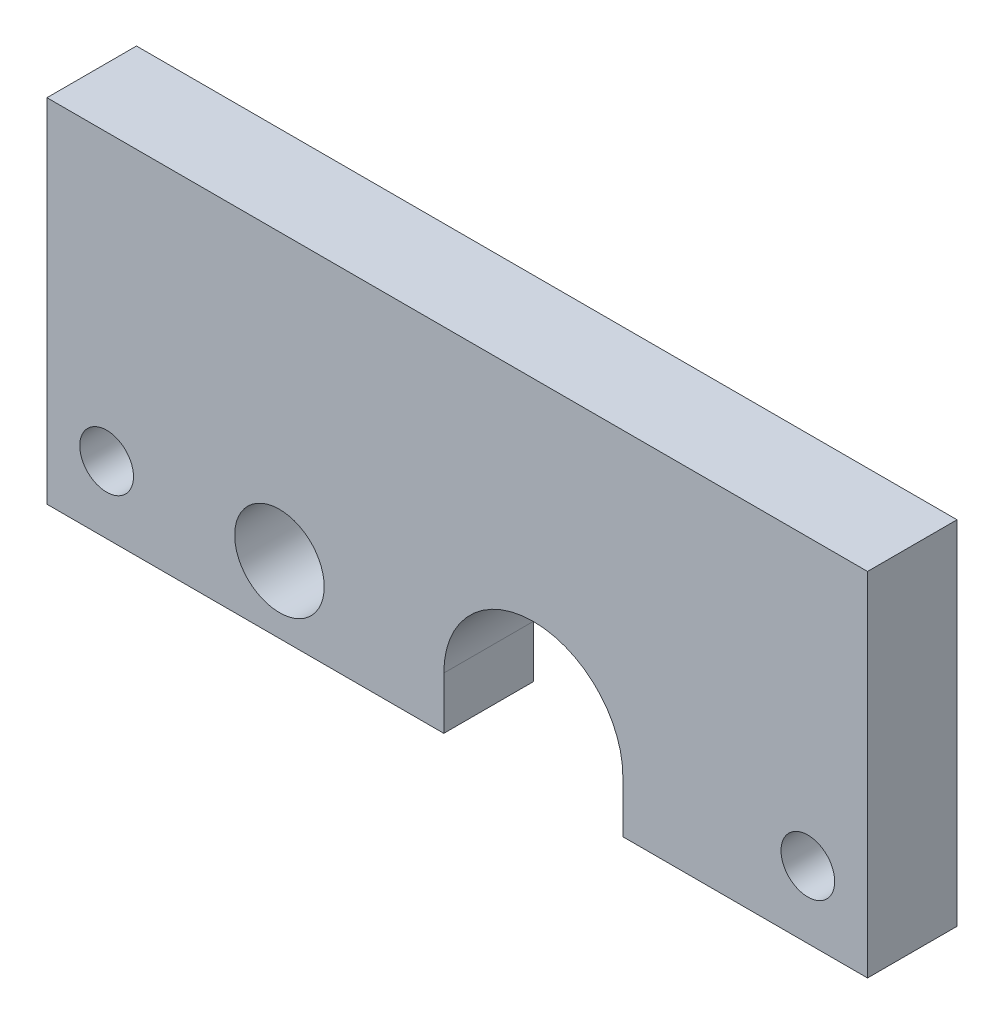
ISO-10303-21;
HEADER;
FILE_DESCRIPTION(('STEP AP214'),'2;1');
FILE_NAME('part.step','',(''),(''),'','','');
FILE_SCHEMA(('AUTOMOTIVE_DESIGN { 1 0 10303 214 1 1 1 1 }'));
ENDSEC;
DATA;
#1=APPLICATION_CONTEXT('core data for automotive mechanical design processes');
#2=APPLICATION_PROTOCOL_DEFINITION('international standard','automotive_design',2000,#1);
#3=PRODUCT_CONTEXT('',#1,'mechanical');
#4=PRODUCT('Part','Part','',(#3));
#5=PRODUCT_RELATED_PRODUCT_CATEGORY('part','',(#4));
#6=PRODUCT_DEFINITION_FORMATION('','',#4);
#7=PRODUCT_DEFINITION_CONTEXT('part definition',#1,'design');
#8=PRODUCT_DEFINITION('design','',#6,#7);
#9=PRODUCT_DEFINITION_SHAPE('','',#8);
#10=(LENGTH_UNIT() NAMED_UNIT(*) SI_UNIT(.MILLI.,.METRE.));
#11=(NAMED_UNIT(*) PLANE_ANGLE_UNIT() SI_UNIT($,.RADIAN.));
#12=(NAMED_UNIT(*) SI_UNIT($,.STERADIAN.) SOLID_ANGLE_UNIT());
#13=UNCERTAINTY_MEASURE_WITH_UNIT(LENGTH_MEASURE(1.E-05),#10,'distance_accuracy_value','');
#14=(GEOMETRIC_REPRESENTATION_CONTEXT(3) GLOBAL_UNCERTAINTY_ASSIGNED_CONTEXT((#13)) GLOBAL_UNIT_ASSIGNED_CONTEXT((#10,
#11,#12)) REPRESENTATION_CONTEXT('',''));
#15=CARTESIAN_POINT('',(0.,0.,0.));
#16=DIRECTION('',(0.,0.,1.));
#17=DIRECTION('',(1.,0.,0.));
#18=AXIS2_PLACEMENT_3D('',#15,#16,#17);
#19=CARTESIAN_POINT('',(59.8841680698545,11.8068201033423,6.));
#20=DIRECTION('',(0.,0.,1.));
#21=DIRECTION('',(1.,0.,0.));
#22=AXIS2_PLACEMENT_3D('',#19,#20,#21);
#23=PLANE('',#22);
#24=CARTESIAN_POINT('',(42.8655843798993,12.8068201033423,6.));
#25=DIRECTION('',(0.,0.,1.));
#26=DIRECTION('',(1.,0.,0.));
#27=AXIS2_PLACEMENT_3D('',#24,#25,#26);
#28=CIRCLE('',#27,3.);
#29=CARTESIAN_POINT('',(45.8655843798993,12.8068201033423,6.));
#30=VERTEX_POINT('',#29);
#31=EDGE_CURVE('E187',#30,#30,#28,.T.);
#32=ORIENTED_EDGE('',*,*,#31,.F.);
#33=EDGE_LOOP('',(#32));
#34=FACE_BOUND('',#33,.T.);
#35=CARTESIAN_POINT('',(59.8841680698545,11.8068201033423,6.));
#36=DIRECTION('',(0.,0.,-1.));
#37=DIRECTION('',(1.,0.,0.));
#38=AXIS2_PLACEMENT_3D('',#35,#36,#37);
#39=CIRCLE('',#38,6.00000000000009);
#40=CARTESIAN_POINT('',(53.8841680698545,11.8068201033423,6.));
#41=VERTEX_POINT('',#40);
#42=CARTESIAN_POINT('',(65.8841680698546,11.8068201033423,6.));
#43=VERTEX_POINT('',#42);
#44=EDGE_CURVE('E150',#41,#43,#39,.T.);
#45=ORIENTED_EDGE('',*,*,#44,.T.);
#46=DIRECTION('',(0.,-1.,0.));
#47=VECTOR('',#46,1.);
#48=CARTESIAN_POINT('',(65.8841680698546,11.8068201033423,6.));
#49=LINE('',#48,#47);
#50=CARTESIAN_POINT('',(65.8841680698546,8.30682010334241,6.));
#51=VERTEX_POINT('',#50);
#52=EDGE_CURVE('E98',#43,#51,#49,.T.);
#53=ORIENTED_EDGE('',*,*,#52,.T.);
#54=DIRECTION('',(1.,0.,0.));
#55=VECTOR('',#54,1.);
#56=CARTESIAN_POINT('',(65.8841680698546,8.30682010334241,6.));
#57=LINE('',#56,#55);
#58=CARTESIAN_POINT('',(82.2841680698542,8.30682010334241,6.));
#59=VERTEX_POINT('',#58);
#60=EDGE_CURVE('E165',#51,#59,#57,.T.);
#61=ORIENTED_EDGE('',*,*,#60,.T.);
#62=DIRECTION('',(0.,1.,0.));
#63=VECTOR('',#62,1.);
#64=CARTESIAN_POINT('',(82.2841680698542,31.9068201033424,6.));
#65=LINE('',#64,#63);
#66=CARTESIAN_POINT('',(82.2841680698542,31.9068201033424,6.));
#67=VERTEX_POINT('',#66);
#68=EDGE_CURVE('E178',#59,#67,#65,.T.);
#69=ORIENTED_EDGE('',*,*,#68,.T.);
#70=DIRECTION('',(-1.,0.,0.));
#71=VECTOR('',#70,1.);
#72=CARTESIAN_POINT('',(27.2841680698545,31.9068201033424,6.));
#73=LINE('',#72,#71);
#74=CARTESIAN_POINT('',(27.2841680698545,31.9068201033424,6.));
#75=VERTEX_POINT('',#74);
#76=EDGE_CURVE('E117',#67,#75,#73,.T.);
#77=ORIENTED_EDGE('',*,*,#76,.T.);
#78=DIRECTION('',(0.,-1.,0.));
#79=VECTOR('',#78,1.);
#80=CARTESIAN_POINT('',(27.2841680698545,8.30682010334241,6.));
#81=LINE('',#80,#79);
#82=CARTESIAN_POINT('',(27.2841680698545,8.30682010334241,6.));
#83=VERTEX_POINT('',#82);
#84=EDGE_CURVE('E111',#75,#83,#81,.T.);
#85=ORIENTED_EDGE('',*,*,#84,.T.);
#86=DIRECTION('',(1.,0.,0.));
#87=VECTOR('',#86,1.);
#88=CARTESIAN_POINT('',(27.2841680698545,8.30682010334241,6.));
#89=LINE('',#88,#87);
#90=CARTESIAN_POINT('',(53.8841680698545,8.30682010334241,6.));
#91=VERTEX_POINT('',#90);
#92=EDGE_CURVE('E115',#83,#91,#89,.T.);
#93=ORIENTED_EDGE('',*,*,#92,.T.);
#94=DIRECTION('',(0.,1.,0.));
#95=VECTOR('',#94,1.);
#96=CARTESIAN_POINT('',(53.8841680698545,11.8068201033423,6.));
#97=LINE('',#96,#95);
#98=EDGE_CURVE('E55',#91,#41,#97,.T.);
#99=ORIENTED_EDGE('',*,*,#98,.T.);
#100=EDGE_LOOP('',(#45,#53,#61,#69,#77,#85,#93,#99));
#101=FACE_BOUND('',#100,.T.);
#102=CARTESIAN_POINT('',(78.2841680698542,12.8068201033423,6.));
#103=DIRECTION('',(0.,0.,1.));
#104=DIRECTION('',(1.,0.,0.));
#105=AXIS2_PLACEMENT_3D('',#102,#103,#104);
#106=CIRCLE('',#105,1.8);
#107=CARTESIAN_POINT('',(80.0841680698542,12.8068201033423,6.));
#108=VERTEX_POINT('',#107);
#109=EDGE_CURVE('E139',#108,#108,#106,.T.);
#110=ORIENTED_EDGE('',*,*,#109,.F.);
#111=EDGE_LOOP('',(#110));
#112=FACE_BOUND('',#111,.T.);
#113=CARTESIAN_POINT('',(31.2841680698543,12.8068201033423,6.));
#114=DIRECTION('',(0.,0.,1.));
#115=DIRECTION('',(1.,0.,0.));
#116=AXIS2_PLACEMENT_3D('',#113,#114,#115);
#117=CIRCLE('',#116,1.8);
#118=CARTESIAN_POINT('',(33.0841680698543,12.8068201033423,6.));
#119=VERTEX_POINT('',#118);
#120=EDGE_CURVE('E193',#119,#119,#117,.T.);
#121=ORIENTED_EDGE('',*,*,#120,.F.);
#122=EDGE_LOOP('',(#121));
#123=FACE_BOUND('',#122,.T.);
#124=ADVANCED_FACE('F38',(#34,#101,#112,#123),#23,.T.);
#125=CARTESIAN_POINT('',(59.8841680698545,11.8068201033423,0.));
#126=DIRECTION('',(0.,0.,1.));
#127=DIRECTION('',(1.,0.,0.));
#128=AXIS2_PLACEMENT_3D('',#125,#126,#127);
#129=PLANE('',#128);
#130=CARTESIAN_POINT('',(59.8841680698545,11.8068201033423,0.));
#131=DIRECTION('',(0.,0.,-1.));
#132=DIRECTION('',(1.,0.,0.));
#133=AXIS2_PLACEMENT_3D('',#130,#131,#132);
#134=CIRCLE('',#133,6.00000000000009);
#135=CARTESIAN_POINT('',(53.8841680698545,11.8068201033423,0.));
#136=VERTEX_POINT('',#135);
#137=CARTESIAN_POINT('',(65.8841680698546,11.8068201033423,0.));
#138=VERTEX_POINT('',#137);
#139=EDGE_CURVE('E135',#136,#138,#134,.T.);
#140=ORIENTED_EDGE('',*,*,#139,.F.);
#141=DIRECTION('',(0.,1.,0.));
#142=VECTOR('',#141,1.);
#143=CARTESIAN_POINT('',(53.8841680698545,11.8068201033423,0.));
#144=LINE('',#143,#142);
#145=CARTESIAN_POINT('',(53.8841680698545,8.30682010334241,0.));
#146=VERTEX_POINT('',#145);
#147=EDGE_CURVE('E90',#146,#136,#144,.T.);
#148=ORIENTED_EDGE('',*,*,#147,.F.);
#149=DIRECTION('',(1.,0.,0.));
#150=VECTOR('',#149,1.);
#151=CARTESIAN_POINT('',(27.2841680698545,8.30682010334241,0.));
#152=LINE('',#151,#150);
#153=CARTESIAN_POINT('',(27.2841680698545,8.30682010334241,0.));
#154=VERTEX_POINT('',#153);
#155=EDGE_CURVE('E84',#154,#146,#152,.T.);
#156=ORIENTED_EDGE('',*,*,#155,.F.);
#157=DIRECTION('',(0.,-1.,0.));
#158=VECTOR('',#157,1.);
#159=CARTESIAN_POINT('',(27.2841680698545,8.30682010334241,0.));
#160=LINE('',#159,#158);
#161=CARTESIAN_POINT('',(27.2841680698545,31.9068201033424,0.));
#162=VERTEX_POINT('',#161);
#163=EDGE_CURVE('E125',#162,#154,#160,.T.);
#164=ORIENTED_EDGE('',*,*,#163,.F.);
#165=DIRECTION('',(-1.,0.,0.));
#166=VECTOR('',#165,1.);
#167=CARTESIAN_POINT('',(27.2841680698545,31.9068201033424,0.));
#168=LINE('',#167,#166);
#169=CARTESIAN_POINT('',(82.2841680698542,31.9068201033424,0.));
#170=VERTEX_POINT('',#169);
#171=EDGE_CURVE('E145',#170,#162,#168,.T.);
#172=ORIENTED_EDGE('',*,*,#171,.F.);
#173=DIRECTION('',(0.,1.,0.));
#174=VECTOR('',#173,1.);
#175=CARTESIAN_POINT('',(82.2841680698542,31.9068201033424,0.));
#176=LINE('',#175,#174);
#177=CARTESIAN_POINT('',(82.2841680698542,8.30682010334241,0.));
#178=VERTEX_POINT('',#177);
#179=EDGE_CURVE('E143',#178,#170,#176,.T.);
#180=ORIENTED_EDGE('',*,*,#179,.F.);
#181=DIRECTION('',(1.,0.,0.));
#182=VECTOR('',#181,1.);
#183=CARTESIAN_POINT('',(65.8841680698546,8.30682010334241,0.));
#184=LINE('',#183,#182);
#185=CARTESIAN_POINT('',(65.8841680698546,8.30682010334241,0.));
#186=VERTEX_POINT('',#185);
#187=EDGE_CURVE('E141',#186,#178,#184,.T.);
#188=ORIENTED_EDGE('',*,*,#187,.F.);
#189=DIRECTION('',(0.,-1.,0.));
#190=VECTOR('',#189,1.);
#191=CARTESIAN_POINT('',(65.8841680698546,11.8068201033423,0.));
#192=LINE('',#191,#190);
#193=EDGE_CURVE('E138',#138,#186,#192,.T.);
#194=ORIENTED_EDGE('',*,*,#193,.F.);
#195=EDGE_LOOP('',(#140,#148,#156,#164,#172,#180,#188,#194));
#196=FACE_BOUND('',#195,.T.);
#197=CARTESIAN_POINT('',(78.2841680698542,12.8068201033423,0.));
#198=DIRECTION('',(0.,0.,1.));
#199=DIRECTION('',(1.,0.,0.));
#200=AXIS2_PLACEMENT_3D('',#197,#198,#199);
#201=CIRCLE('',#200,1.8);
#202=CARTESIAN_POINT('',(80.0841680698542,12.8068201033423,0.));
#203=VERTEX_POINT('',#202);
#204=EDGE_CURVE('E184',#203,#203,#201,.T.);
#205=ORIENTED_EDGE('',*,*,#204,.T.);
#206=EDGE_LOOP('',(#205));
#207=FACE_BOUND('',#206,.T.);
#208=CARTESIAN_POINT('',(42.8655843798993,12.8068201033423,0.));
#209=DIRECTION('',(0.,0.,1.));
#210=DIRECTION('',(1.,0.,0.));
#211=AXIS2_PLACEMENT_3D('',#208,#209,#210);
#212=CIRCLE('',#211,3.);
#213=CARTESIAN_POINT('',(45.8655843798993,12.8068201033423,0.));
#214=VERTEX_POINT('',#213);
#215=EDGE_CURVE('E190',#214,#214,#212,.T.);
#216=ORIENTED_EDGE('',*,*,#215,.T.);
#217=EDGE_LOOP('',(#216));
#218=FACE_BOUND('',#217,.T.);
#219=CARTESIAN_POINT('',(31.2841680698543,12.8068201033423,0.));
#220=DIRECTION('',(0.,0.,1.));
#221=DIRECTION('',(1.,0.,0.));
#222=AXIS2_PLACEMENT_3D('',#219,#220,#221);
#223=CIRCLE('',#222,1.8);
#224=CARTESIAN_POINT('',(33.0841680698543,12.8068201033423,0.));
#225=VERTEX_POINT('',#224);
#226=EDGE_CURVE('E196',#225,#225,#223,.T.);
#227=ORIENTED_EDGE('',*,*,#226,.T.);
#228=EDGE_LOOP('',(#227));
#229=FACE_BOUND('',#228,.T.);
#230=ADVANCED_FACE('F169',(#196,#207,#218,#229),#129,.F.);
#231=CARTESIAN_POINT('',(59.8841680698545,11.8068201033423,6.));
#232=DIRECTION('',(0.,0.,-1.));
#233=DIRECTION('',(-1.,0.,0.));
#234=AXIS2_PLACEMENT_3D('',#231,#232,#233);
#235=CYLINDRICAL_SURFACE('',#234,6.00000000000009);
#236=ORIENTED_EDGE('',*,*,#139,.T.);
#237=DIRECTION('',(0.,0.,-1.));
#238=VECTOR('',#237,1.);
#239=CARTESIAN_POINT('',(65.8841680698546,11.8068201033423,6.));
#240=LINE('',#239,#238);
#241=EDGE_CURVE('E11',#43,#138,#240,.T.);
#242=ORIENTED_EDGE('',*,*,#241,.F.);
#243=ORIENTED_EDGE('',*,*,#44,.F.);
#244=DIRECTION('',(0.,0.,-1.));
#245=VECTOR('',#244,1.);
#246=CARTESIAN_POINT('',(53.8841680698545,11.8068201033423,6.));
#247=LINE('',#246,#245);
#248=EDGE_CURVE('E131',#41,#136,#247,.T.);
#249=ORIENTED_EDGE('',*,*,#248,.T.);
#250=EDGE_LOOP('',(#236,#242,#243,#249));
#251=FACE_BOUND('',#250,.T.);
#252=ADVANCED_FACE('F40',(#251),#235,.F.);
#253=CARTESIAN_POINT('',(65.8841680698546,11.8068201033423,6.));
#254=DIRECTION('',(1.,0.,0.));
#255=DIRECTION('',(0.,0.,-1.));
#256=AXIS2_PLACEMENT_3D('',#253,#254,#255);
#257=PLANE('',#256);
#258=ORIENTED_EDGE('',*,*,#193,.T.);
#259=DIRECTION('',(0.,0.,-1.));
#260=VECTOR('',#259,1.);
#261=CARTESIAN_POINT('',(65.8841680698546,8.30682010334241,6.));
#262=LINE('',#261,#260);
#263=EDGE_CURVE('E47',#51,#186,#262,.T.);
#264=ORIENTED_EDGE('',*,*,#263,.F.);
#265=ORIENTED_EDGE('',*,*,#52,.F.);
#266=ORIENTED_EDGE('',*,*,#241,.T.);
#267=EDGE_LOOP('',(#258,#264,#265,#266));
#268=FACE_BOUND('',#267,.T.);
#269=ADVANCED_FACE('F228',(#268),#257,.F.);
#270=CARTESIAN_POINT('',(65.8841680698546,8.30682010334241,6.));
#271=DIRECTION('',(0.,1.,0.));
#272=DIRECTION('',(0.,0.,1.));
#273=AXIS2_PLACEMENT_3D('',#270,#271,#272);
#274=PLANE('',#273);
#275=ORIENTED_EDGE('',*,*,#187,.T.);
#276=DIRECTION('',(0.,0.,-1.));
#277=VECTOR('',#276,1.);
#278=CARTESIAN_POINT('',(82.2841680698542,8.30682010334241,6.));
#279=LINE('',#278,#277);
#280=EDGE_CURVE('E157',#59,#178,#279,.T.);
#281=ORIENTED_EDGE('',*,*,#280,.F.);
#282=ORIENTED_EDGE('',*,*,#60,.F.);
#283=ORIENTED_EDGE('',*,*,#263,.T.);
#284=EDGE_LOOP('',(#275,#281,#282,#283));
#285=FACE_BOUND('',#284,.T.);
#286=ADVANCED_FACE('F163',(#285),#274,.F.);
#287=CARTESIAN_POINT('',(82.2841680698542,31.9068201033424,6.));
#288=DIRECTION('',(-1.,0.,0.));
#289=DIRECTION('',(0.,0.,1.));
#290=AXIS2_PLACEMENT_3D('',#287,#288,#289);
#291=PLANE('',#290);
#292=ORIENTED_EDGE('',*,*,#179,.T.);
#293=DIRECTION('',(0.,0.,-1.));
#294=VECTOR('',#293,1.);
#295=CARTESIAN_POINT('',(82.2841680698542,31.9068201033424,6.));
#296=LINE('',#295,#294);
#297=EDGE_CURVE('E154',#67,#170,#296,.T.);
#298=ORIENTED_EDGE('',*,*,#297,.F.);
#299=ORIENTED_EDGE('',*,*,#68,.F.);
#300=ORIENTED_EDGE('',*,*,#280,.T.);
#301=EDGE_LOOP('',(#292,#298,#299,#300));
#302=FACE_BOUND('',#301,.T.);
#303=ADVANCED_FACE('F174',(#302),#291,.F.);
#304=CARTESIAN_POINT('',(27.2841680698545,31.9068201033424,6.));
#305=DIRECTION('',(0.,-1.,0.));
#306=DIRECTION('',(0.,0.,-1.));
#307=AXIS2_PLACEMENT_3D('',#304,#305,#306);
#308=PLANE('',#307);
#309=ORIENTED_EDGE('',*,*,#171,.T.);
#310=DIRECTION('',(0.,0.,-1.));
#311=VECTOR('',#310,1.);
#312=CARTESIAN_POINT('',(27.2841680698545,31.9068201033424,6.));
#313=LINE('',#312,#311);
#314=EDGE_CURVE('E126',#75,#162,#313,.T.);
#315=ORIENTED_EDGE('',*,*,#314,.F.);
#316=ORIENTED_EDGE('',*,*,#76,.F.);
#317=ORIENTED_EDGE('',*,*,#297,.T.);
#318=EDGE_LOOP('',(#309,#315,#316,#317));
#319=FACE_BOUND('',#318,.T.);
#320=ADVANCED_FACE('F177',(#319),#308,.F.);
#321=CARTESIAN_POINT('',(27.2841680698545,8.30682010334241,6.));
#322=DIRECTION('',(1.,0.,0.));
#323=DIRECTION('',(0.,0.,-1.));
#324=AXIS2_PLACEMENT_3D('',#321,#322,#323);
#325=PLANE('',#324);
#326=ORIENTED_EDGE('',*,*,#163,.T.);
#327=DIRECTION('',(0.,0.,-1.));
#328=VECTOR('',#327,1.);
#329=CARTESIAN_POINT('',(27.2841680698545,8.30682010334241,6.));
#330=LINE('',#329,#328);
#331=EDGE_CURVE('E122',#83,#154,#330,.T.);
#332=ORIENTED_EDGE('',*,*,#331,.F.);
#333=ORIENTED_EDGE('',*,*,#84,.F.);
#334=ORIENTED_EDGE('',*,*,#314,.T.);
#335=EDGE_LOOP('',(#326,#332,#333,#334));
#336=FACE_BOUND('',#335,.T.);
#337=ADVANCED_FACE('F123',(#336),#325,.F.);
#338=CARTESIAN_POINT('',(27.2841680698545,8.30682010334241,6.));
#339=DIRECTION('',(0.,1.,0.));
#340=DIRECTION('',(0.,0.,1.));
#341=AXIS2_PLACEMENT_3D('',#338,#339,#340);
#342=PLANE('',#341);
#343=ORIENTED_EDGE('',*,*,#155,.T.);
#344=DIRECTION('',(0.,0.,-1.));
#345=VECTOR('',#344,1.);
#346=CARTESIAN_POINT('',(53.8841680698545,8.30682010334241,6.));
#347=LINE('',#346,#345);
#348=EDGE_CURVE('E127',#91,#146,#347,.T.);
#349=ORIENTED_EDGE('',*,*,#348,.F.);
#350=ORIENTED_EDGE('',*,*,#92,.F.);
#351=ORIENTED_EDGE('',*,*,#331,.T.);
#352=EDGE_LOOP('',(#343,#349,#350,#351));
#353=FACE_BOUND('',#352,.T.);
#354=ADVANCED_FACE('F129',(#353),#342,.F.);
#355=CARTESIAN_POINT('',(53.8841680698545,11.8068201033423,6.));
#356=DIRECTION('',(-1.,0.,0.));
#357=DIRECTION('',(0.,0.,1.));
#358=AXIS2_PLACEMENT_3D('',#355,#356,#357);
#359=PLANE('',#358);
#360=ORIENTED_EDGE('',*,*,#147,.T.);
#361=ORIENTED_EDGE('',*,*,#248,.F.);
#362=ORIENTED_EDGE('',*,*,#98,.F.);
#363=ORIENTED_EDGE('',*,*,#348,.T.);
#364=EDGE_LOOP('',(#360,#361,#362,#363));
#365=FACE_BOUND('',#364,.T.);
#366=ADVANCED_FACE('F216',(#365),#359,.F.);
#367=CARTESIAN_POINT('',(78.2841680698542,12.8068201033423,6.));
#368=DIRECTION('',(0.,0.,-1.));
#369=DIRECTION('',(-1.,0.,0.));
#370=AXIS2_PLACEMENT_3D('',#367,#368,#369);
#371=CYLINDRICAL_SURFACE('',#370,1.8);
#372=ORIENTED_EDGE('',*,*,#109,.T.);
#373=EDGE_LOOP('',(#372));
#374=FACE_BOUND('',#373,.T.);
#375=ORIENTED_EDGE('',*,*,#204,.F.);
#376=EDGE_LOOP('',(#375));
#377=FACE_BOUND('',#376,.T.);
#378=ADVANCED_FACE('F213',(#374,#377),#371,.F.);
#379=CARTESIAN_POINT('',(42.8655843798993,12.8068201033423,6.));
#380=DIRECTION('',(0.,0.,-1.));
#381=DIRECTION('',(-1.,0.,0.));
#382=AXIS2_PLACEMENT_3D('',#379,#380,#381);
#383=CYLINDRICAL_SURFACE('',#382,3.);
#384=ORIENTED_EDGE('',*,*,#31,.T.);
#385=EDGE_LOOP('',(#384));
#386=FACE_BOUND('',#385,.T.);
#387=ORIENTED_EDGE('',*,*,#215,.F.);
#388=EDGE_LOOP('',(#387));
#389=FACE_BOUND('',#388,.T.);
#390=ADVANCED_FACE('F296',(#386,#389),#383,.F.);
#391=CARTESIAN_POINT('',(31.2841680698543,12.8068201033423,6.));
#392=DIRECTION('',(0.,0.,-1.));
#393=DIRECTION('',(-1.,0.,0.));
#394=AXIS2_PLACEMENT_3D('',#391,#392,#393);
#395=CYLINDRICAL_SURFACE('',#394,1.8);
#396=ORIENTED_EDGE('',*,*,#120,.T.);
#397=EDGE_LOOP('',(#396));
#398=FACE_BOUND('',#397,.T.);
#399=ORIENTED_EDGE('',*,*,#226,.F.);
#400=EDGE_LOOP('',(#399));
#401=FACE_BOUND('',#400,.T.);
#402=ADVANCED_FACE('F202',(#398,#401),#395,.F.);
#403=CLOSED_SHELL('',(#124,#230,#252,#269,#286,#303,#320,#337,#354,#366,#378,#390,#402));
#404=MANIFOLD_SOLID_BREP('B2',#403);
#405=ADVANCED_BREP_SHAPE_REPRESENTATION('',(#18,#404),#14);
#406=SHAPE_DEFINITION_REPRESENTATION(#9,#405);
ENDSEC;
END-ISO-10303-21;
